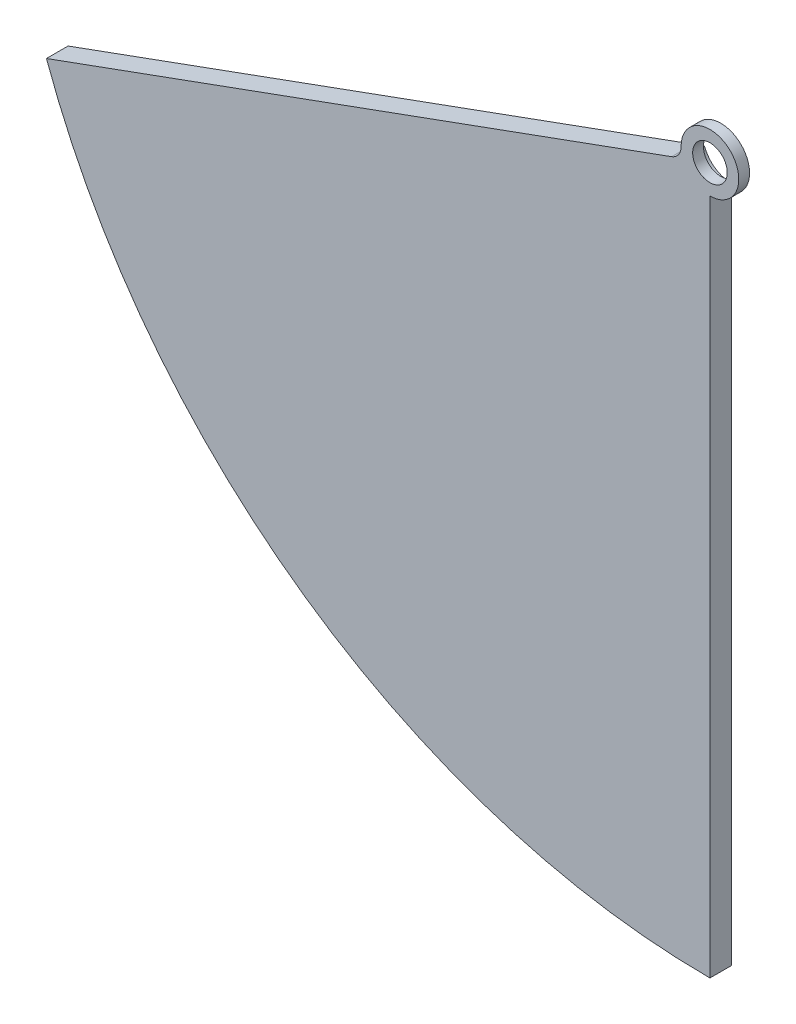
ISO-10303-21;
HEADER;
FILE_DESCRIPTION(('STEP AP214'),'2;1');
FILE_NAME('part.step','',(''),(''),'','','');
FILE_SCHEMA(('AUTOMOTIVE_DESIGN { 1 0 10303 214 1 1 1 1 }'));
ENDSEC;
DATA;
#1=APPLICATION_CONTEXT('core data for automotive mechanical design processes');
#2=APPLICATION_PROTOCOL_DEFINITION('international standard','automotive_design',2000,#1);
#3=PRODUCT_CONTEXT('',#1,'mechanical');
#4=PRODUCT('Part','Part','',(#3));
#5=PRODUCT_RELATED_PRODUCT_CATEGORY('part','',(#4));
#6=PRODUCT_DEFINITION_FORMATION('','',#4);
#7=PRODUCT_DEFINITION_CONTEXT('part definition',#1,'design');
#8=PRODUCT_DEFINITION('design','',#6,#7);
#9=PRODUCT_DEFINITION_SHAPE('','',#8);
#10=(LENGTH_UNIT() NAMED_UNIT(*) SI_UNIT(.MILLI.,.METRE.));
#11=(NAMED_UNIT(*) PLANE_ANGLE_UNIT() SI_UNIT($,.RADIAN.));
#12=(NAMED_UNIT(*) SI_UNIT($,.STERADIAN.) SOLID_ANGLE_UNIT());
#13=UNCERTAINTY_MEASURE_WITH_UNIT(LENGTH_MEASURE(1.E-05),#10,'distance_accuracy_value','');
#14=(GEOMETRIC_REPRESENTATION_CONTEXT(3) GLOBAL_UNCERTAINTY_ASSIGNED_CONTEXT((#13)) GLOBAL_UNIT_ASSIGNED_CONTEXT((#10,
#11,#12)) REPRESENTATION_CONTEXT('',''));
#15=CARTESIAN_POINT('',(0.,0.,0.));
#16=DIRECTION('',(0.,0.,1.));
#17=DIRECTION('',(1.,0.,0.));
#18=AXIS2_PLACEMENT_3D('',#15,#16,#17);
#19=CARTESIAN_POINT('',(0.,0.,15.));
#20=DIRECTION('',(0.,0.,-1.));
#21=DIRECTION('',(-1.,0.,0.));
#22=AXIS2_PLACEMENT_3D('',#19,#20,#21);
#23=CYLINDRICAL_SURFACE('',#22,20.);
#24=CARTESIAN_POINT('',(0.,0.,7.5));
#25=DIRECTION('',(0.,0.,-1.));
#26=DIRECTION('',(-1.,0.,0.));
#27=AXIS2_PLACEMENT_3D('',#24,#25,#26);
#28=CIRCLE('',#27,20.);
#29=CARTESIAN_POINT('',(-19.9991482725358,-0.184576198706586,7.5));
#30=VERTEX_POINT('',#29);
#31=CARTESIAN_POINT('',(0.,-20.,7.5));
#32=VERTEX_POINT('',#31);
#33=EDGE_CURVE('E118',#30,#32,#28,.T.);
#34=ORIENTED_EDGE('',*,*,#33,.F.);
#35=DIRECTION('',(0.,0.,-1.));
#36=VECTOR('',#35,1.);
#37=CARTESIAN_POINT('',(-19.9991482725358,-0.184576198706586,15.));
#38=LINE('',#37,#36);
#39=CARTESIAN_POINT('',(-19.9991482725358,-0.184576198706586,15.));
#40=VERTEX_POINT('',#39);
#41=EDGE_CURVE('E54',#30,#40,#38,.F.);
#42=ORIENTED_EDGE('',*,*,#41,.T.);
#43=CARTESIAN_POINT('',(0.,0.,15.));
#44=DIRECTION('',(0.,0.,1.));
#45=DIRECTION('',(1.,0.,0.));
#46=AXIS2_PLACEMENT_3D('',#43,#44,#45);
#47=CIRCLE('',#46,20.);
#48=CARTESIAN_POINT('',(0.,-20.,15.));
#49=VERTEX_POINT('',#48);
#50=EDGE_CURVE('E161',#49,#40,#47,.T.);
#51=ORIENTED_EDGE('',*,*,#50,.F.);
#52=DIRECTION('',(0.,0.,-1.));
#53=VECTOR('',#52,1.);
#54=CARTESIAN_POINT('',(0.,-20.,15.));
#55=LINE('',#54,#53);
#56=EDGE_CURVE('E142',#49,#32,#55,.T.);
#57=ORIENTED_EDGE('',*,*,#56,.T.);
#58=EDGE_LOOP('',(#34,#42,#51,#57));
#59=FACE_BOUND('',#58,.T.);
#60=ADVANCED_FACE('F38',(#59),#23,.T.);
#61=CARTESIAN_POINT('',(0.,0.,15.));
#62=DIRECTION('',(0.,0.,-1.));
#63=DIRECTION('',(-1.,0.,0.));
#64=AXIS2_PLACEMENT_3D('',#61,#62,#63);
#65=CYLINDRICAL_SURFACE('',#64,12.);
#66=CARTESIAN_POINT('',(0.,0.,15.));
#67=DIRECTION('',(0.,0.,1.));
#68=DIRECTION('',(1.,0.,0.));
#69=AXIS2_PLACEMENT_3D('',#66,#67,#68);
#70=CIRCLE('',#69,12.);
#71=CARTESIAN_POINT('',(12.,0.,15.));
#72=VERTEX_POINT('',#71);
#73=EDGE_CURVE('E107',#72,#72,#70,.T.);
#74=ORIENTED_EDGE('',*,*,#73,.T.);
#75=EDGE_LOOP('',(#74));
#76=FACE_BOUND('',#75,.T.);
#77=CARTESIAN_POINT('',(0.,0.,7.5));
#78=DIRECTION('',(0.,0.,-1.));
#79=DIRECTION('',(-1.,0.,0.));
#80=AXIS2_PLACEMENT_3D('',#77,#78,#79);
#81=CIRCLE('',#80,12.);
#82=CARTESIAN_POINT('',(-12.,0.,7.5));
#83=VERTEX_POINT('',#82);
#84=EDGE_CURVE('E108',#83,#83,#81,.T.);
#85=ORIENTED_EDGE('',*,*,#84,.T.);
#86=EDGE_LOOP('',(#85));
#87=FACE_BOUND('',#86,.T.);
#88=ADVANCED_FACE('F197',(#76,#87),#65,.F.);
#89=CARTESIAN_POINT('',(0.,0.,15.));
#90=DIRECTION('',(0.,0.,1.));
#91=DIRECTION('',(1.,0.,0.));
#92=AXIS2_PLACEMENT_3D('',#89,#90,#91);
#93=PLANE('',#92);
#94=CARTESIAN_POINT('',(0.,0.,15.));
#95=DIRECTION('',(0.,0.,1.));
#96=DIRECTION('',(1.,0.,0.));
#97=AXIS2_PLACEMENT_3D('',#94,#95,#96);
#98=CIRCLE('',#97,490.);
#99=CARTESIAN_POINT('',(-460.449384185096,-167.589870229576,15.));
#100=VERTEX_POINT('',#99);
#101=CARTESIAN_POINT('',(0.,-490.,15.));
#102=VERTEX_POINT('',#101);
#103=EDGE_CURVE('E129',#100,#102,#98,.T.);
#104=ORIENTED_EDGE('',*,*,#103,.T.);
#105=DIRECTION('',(0.,1.,0.));
#106=VECTOR('',#105,1.);
#107=CARTESIAN_POINT('',(0.,-20.,15.));
#108=LINE('',#107,#106);
#109=EDGE_CURVE('E163',#102,#49,#108,.T.);
#110=ORIENTED_EDGE('',*,*,#109,.T.);
#111=ORIENTED_EDGE('',*,*,#50,.T.);
#112=CARTESIAN_POINT('',(-29.9987224088037,-0.276864298059879,15.));
#113=DIRECTION('',(0.,0.,1.));
#114=DIRECTION('',(1.,0.,0.));
#115=AXIS2_PLACEMENT_3D('',#112,#113,#114);
#116=CIRCLE('',#115,10.);
#117=CARTESIAN_POINT('',(-26.578520975547,-9.67379050591897,15.));
#118=VERTEX_POINT('',#117);
#119=EDGE_CURVE('E11',#40,#118,#116,.F.);
#120=ORIENTED_EDGE('',*,*,#119,.T.);
#121=DIRECTION('',(-0.939692620785909,-0.342020143325666,0.));
#122=VECTOR('',#121,1.);
#123=CARTESIAN_POINT('',(-18.7938524157182,-6.84040286651335,15.));
#124=LINE('',#123,#122);
#125=EDGE_CURVE('E139',#118,#100,#124,.T.);
#126=ORIENTED_EDGE('',*,*,#125,.T.);
#127=EDGE_LOOP('',(#104,#110,#111,#120,#126));
#128=FACE_BOUND('',#127,.T.);
#129=ORIENTED_EDGE('',*,*,#73,.F.);
#130=EDGE_LOOP('',(#129));
#131=FACE_BOUND('',#130,.T.);
#132=ADVANCED_FACE('F182',(#128,#131),#93,.T.);
#133=CARTESIAN_POINT('',(0.,0.,0.));
#134=DIRECTION('',(0.,0.,1.));
#135=DIRECTION('',(1.,0.,0.));
#136=AXIS2_PLACEMENT_3D('',#133,#134,#135);
#137=PLANE('',#136);
#138=DIRECTION('',(-0.939692620785909,-0.342020143325666,0.));
#139=VECTOR('',#138,1.);
#140=CARTESIAN_POINT('',(-18.7938524157182,-6.84040286651335,0.));
#141=LINE('',#140,#139);
#142=CARTESIAN_POINT('',(-18.7938524157182,-6.84040286651336,0.));
#143=VERTEX_POINT('',#142);
#144=CARTESIAN_POINT('',(-460.449384185096,-167.589870229576,0.));
#145=VERTEX_POINT('',#144);
#146=EDGE_CURVE('E116',#143,#145,#141,.T.);
#147=ORIENTED_EDGE('',*,*,#146,.F.);
#148=CARTESIAN_POINT('',(0.,0.,0.));
#149=DIRECTION('',(0.,0.,-1.));
#150=DIRECTION('',(-1.,0.,0.));
#151=AXIS2_PLACEMENT_3D('',#148,#149,#150);
#152=CIRCLE('',#151,20.);
#153=CARTESIAN_POINT('',(0.,-20.,0.));
#154=VERTEX_POINT('',#153);
#155=EDGE_CURVE('E98',#154,#143,#152,.T.);
#156=ORIENTED_EDGE('',*,*,#155,.F.);
#157=DIRECTION('',(0.,1.,0.));
#158=VECTOR('',#157,1.);
#159=CARTESIAN_POINT('',(0.,-20.,0.));
#160=LINE('',#159,#158);
#161=CARTESIAN_POINT('',(0.,-490.,0.));
#162=VERTEX_POINT('',#161);
#163=EDGE_CURVE('E114',#162,#154,#160,.T.);
#164=ORIENTED_EDGE('',*,*,#163,.F.);
#165=CARTESIAN_POINT('',(0.,0.,0.));
#166=DIRECTION('',(0.,0.,1.));
#167=DIRECTION('',(1.,0.,0.));
#168=AXIS2_PLACEMENT_3D('',#165,#166,#167);
#169=CIRCLE('',#168,490.);
#170=EDGE_CURVE('E125',#145,#162,#169,.T.);
#171=ORIENTED_EDGE('',*,*,#170,.F.);
#172=EDGE_LOOP('',(#147,#156,#164,#171));
#173=FACE_BOUND('',#172,.T.);
#174=ADVANCED_FACE('F112',(#173),#137,.F.);
#175=CARTESIAN_POINT('',(0.,0.,15.));
#176=DIRECTION('',(0.,0.,-1.));
#177=DIRECTION('',(-1.,0.,0.));
#178=AXIS2_PLACEMENT_3D('',#175,#176,#177);
#179=CYLINDRICAL_SURFACE('',#178,490.);
#180=ORIENTED_EDGE('',*,*,#170,.T.);
#181=DIRECTION('',(0.,0.,-1.));
#182=VECTOR('',#181,1.);
#183=CARTESIAN_POINT('',(0.,-490.,15.));
#184=LINE('',#183,#182);
#185=EDGE_CURVE('E122',#102,#162,#184,.T.);
#186=ORIENTED_EDGE('',*,*,#185,.F.);
#187=ORIENTED_EDGE('',*,*,#103,.F.);
#188=DIRECTION('',(0.,0.,-1.));
#189=VECTOR('',#188,1.);
#190=CARTESIAN_POINT('',(-460.449384185096,-167.589870229576,15.));
#191=LINE('',#190,#189);
#192=EDGE_CURVE('E134',#100,#145,#191,.T.);
#193=ORIENTED_EDGE('',*,*,#192,.T.);
#194=EDGE_LOOP('',(#180,#186,#187,#193));
#195=FACE_BOUND('',#194,.T.);
#196=ADVANCED_FACE('F188',(#195),#179,.T.);
#197=CARTESIAN_POINT('',(0.,-20.,15.));
#198=DIRECTION('',(-1.,0.,0.));
#199=DIRECTION('',(0.,-1.,0.));
#200=AXIS2_PLACEMENT_3D('',#197,#198,#199);
#201=PLANE('',#200);
#202=ORIENTED_EDGE('',*,*,#163,.T.);
#203=DIRECTION('',(0.,0.,-1.));
#204=VECTOR('',#203,1.);
#205=CARTESIAN_POINT('',(0.,-20.,7.5));
#206=LINE('',#205,#204);
#207=EDGE_CURVE('E94',#154,#32,#206,.F.);
#208=ORIENTED_EDGE('',*,*,#207,.T.);
#209=ORIENTED_EDGE('',*,*,#56,.F.);
#210=ORIENTED_EDGE('',*,*,#109,.F.);
#211=ORIENTED_EDGE('',*,*,#185,.T.);
#212=EDGE_LOOP('',(#202,#208,#209,#210,#211));
#213=FACE_BOUND('',#212,.T.);
#214=ADVANCED_FACE('F120',(#213),#201,.F.);
#215=CARTESIAN_POINT('',(-18.7938524157182,-6.84040286651335,15.));
#216=DIRECTION('',(0.342020143325666,-0.939692620785909,0.));
#217=DIRECTION('',(0.939692620785909,0.342020143325666,0.));
#218=AXIS2_PLACEMENT_3D('',#215,#216,#217);
#219=PLANE('',#218);
#220=ORIENTED_EDGE('',*,*,#125,.F.);
#221=DIRECTION('',(0.,0.,1.));
#222=VECTOR('',#221,1.);
#223=CARTESIAN_POINT('',(-26.578520975547,-9.67379050591897,7.5));
#224=LINE('',#223,#222);
#225=CARTESIAN_POINT('',(-26.578520975547,-9.67379050591897,7.5));
#226=VERTEX_POINT('',#225);
#227=EDGE_CURVE('E153',#118,#226,#224,.F.);
#228=ORIENTED_EDGE('',*,*,#227,.T.);
#229=DIRECTION('',(0.939692620785909,0.342020143325666,0.));
#230=VECTOR('',#229,1.);
#231=CARTESIAN_POINT('',(-18.7938524157182,-6.84040286651335,7.5));
#232=LINE('',#231,#230);
#233=CARTESIAN_POINT('',(-18.7938524157182,-6.84040286651335,7.5));
#234=VERTEX_POINT('',#233);
#235=EDGE_CURVE('E147',#226,#234,#232,.T.);
#236=ORIENTED_EDGE('',*,*,#235,.T.);
#237=DIRECTION('',(0.,0.,-1.));
#238=VECTOR('',#237,1.);
#239=CARTESIAN_POINT('',(-18.7938524157182,-6.84040286651336,15.));
#240=LINE('',#239,#238);
#241=EDGE_CURVE('E138',#234,#143,#240,.T.);
#242=ORIENTED_EDGE('',*,*,#241,.T.);
#243=ORIENTED_EDGE('',*,*,#146,.T.);
#244=ORIENTED_EDGE('',*,*,#192,.F.);
#245=EDGE_LOOP('',(#220,#228,#236,#242,#243,#244));
#246=FACE_BOUND('',#245,.T.);
#247=ADVANCED_FACE('F186',(#246),#219,.F.);
#248=CARTESIAN_POINT('',(0.,0.,7.5));
#249=DIRECTION('',(0.,0.,-1.));
#250=DIRECTION('',(-1.,0.,0.));
#251=AXIS2_PLACEMENT_3D('',#248,#249,#250);
#252=CYLINDRICAL_SURFACE('',#251,20.);
#253=ORIENTED_EDGE('',*,*,#155,.T.);
#254=ORIENTED_EDGE('',*,*,#241,.F.);
#255=EDGE_CURVE('E101',#32,#234,#28,.T.);
#256=ORIENTED_EDGE('',*,*,#255,.F.);
#257=ORIENTED_EDGE('',*,*,#207,.F.);
#258=EDGE_LOOP('',(#253,#254,#256,#257));
#259=FACE_BOUND('',#258,.T.);
#260=ADVANCED_FACE('F96',(#259),#252,.F.);
#261=CARTESIAN_POINT('',(0.,0.,7.5));
#262=DIRECTION('',(0.,0.,-1.));
#263=DIRECTION('',(-1.,0.,0.));
#264=AXIS2_PLACEMENT_3D('',#261,#262,#263);
#265=PLANE('',#264);
#266=ORIENTED_EDGE('',*,*,#84,.F.);
#267=EDGE_LOOP('',(#266));
#268=FACE_BOUND('',#267,.T.);
#269=ORIENTED_EDGE('',*,*,#255,.T.);
#270=ORIENTED_EDGE('',*,*,#235,.F.);
#271=CARTESIAN_POINT('',(-29.9987224088037,-0.276864298059879,7.5));
#272=DIRECTION('',(0.,0.,-1.));
#273=DIRECTION('',(-1.,0.,0.));
#274=AXIS2_PLACEMENT_3D('',#271,#272,#273);
#275=CIRCLE('',#274,10.);
#276=EDGE_CURVE('E47',#226,#30,#275,.F.);
#277=ORIENTED_EDGE('',*,*,#276,.T.);
#278=ORIENTED_EDGE('',*,*,#33,.T.);
#279=EDGE_LOOP('',(#269,#270,#277,#278));
#280=FACE_BOUND('',#279,.T.);
#281=ADVANCED_FACE('F177',(#268,#280),#265,.T.);
#282=CARTESIAN_POINT('',(-29.9987224088037,-0.276864298059879,15.));
#283=DIRECTION('',(0.,0.,-1.));
#284=DIRECTION('',(-1.,0.,0.));
#285=AXIS2_PLACEMENT_3D('',#282,#283,#284);
#286=CYLINDRICAL_SURFACE('',#285,10.);
#287=ORIENTED_EDGE('',*,*,#119,.F.);
#288=ORIENTED_EDGE('',*,*,#41,.F.);
#289=ORIENTED_EDGE('',*,*,#276,.F.);
#290=ORIENTED_EDGE('',*,*,#227,.F.);
#291=EDGE_LOOP('',(#287,#288,#289,#290));
#292=FACE_BOUND('',#291,.T.);
#293=ADVANCED_FACE('F40',(#292),#286,.F.);
#294=CLOSED_SHELL('',(#60,#88,#132,#174,#196,#214,#247,#260,#281,#293));
#295=MANIFOLD_SOLID_BREP('B2',#294);
#296=ADVANCED_BREP_SHAPE_REPRESENTATION('',(#18,#295),#14);
#297=SHAPE_DEFINITION_REPRESENTATION(#9,#296);
ENDSEC;
END-ISO-10303-21;
